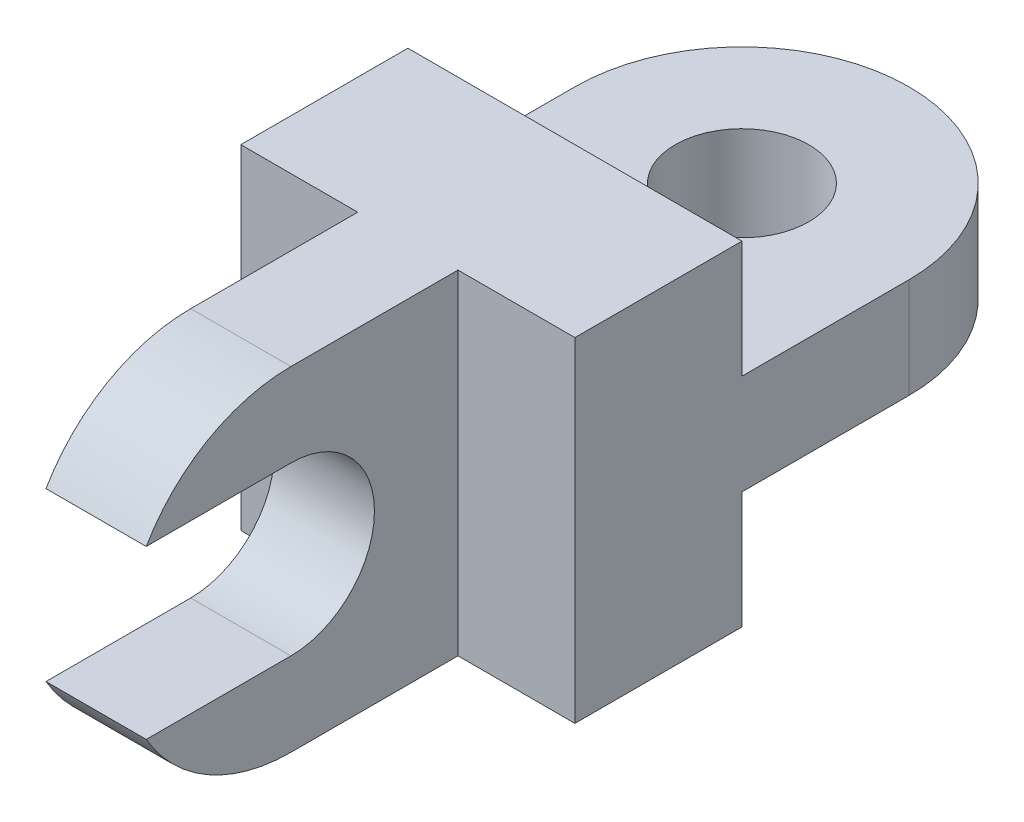
ISO-10303-21;
HEADER;
FILE_DESCRIPTION(('STEP AP214'),'2;1');
FILE_NAME('part.step','',(''),(''),'','','');
FILE_SCHEMA(('AUTOMOTIVE_DESIGN { 1 0 10303 214 1 1 1 1 }'));
ENDSEC;
DATA;
#1=APPLICATION_CONTEXT('core data for automotive mechanical design processes');
#2=APPLICATION_PROTOCOL_DEFINITION('international standard','automotive_design',2000,#1);
#3=PRODUCT_CONTEXT('',#1,'mechanical');
#4=PRODUCT('Part','Part','',(#3));
#5=PRODUCT_RELATED_PRODUCT_CATEGORY('part','',(#4));
#6=PRODUCT_DEFINITION_FORMATION('','',#4);
#7=PRODUCT_DEFINITION_CONTEXT('part definition',#1,'design');
#8=PRODUCT_DEFINITION('design','',#6,#7);
#9=PRODUCT_DEFINITION_SHAPE('','',#8);
#10=(LENGTH_UNIT() NAMED_UNIT(*) SI_UNIT(.MILLI.,.METRE.));
#11=(NAMED_UNIT(*) PLANE_ANGLE_UNIT() SI_UNIT($,.RADIAN.));
#12=(NAMED_UNIT(*) SI_UNIT($,.STERADIAN.) SOLID_ANGLE_UNIT());
#13=UNCERTAINTY_MEASURE_WITH_UNIT(LENGTH_MEASURE(1.E-05),#10,'distance_accuracy_value','');
#14=(GEOMETRIC_REPRESENTATION_CONTEXT(3) GLOBAL_UNCERTAINTY_ASSIGNED_CONTEXT((#13)) GLOBAL_UNIT_ASSIGNED_CONTEXT((#10,
#11,#12)) REPRESENTATION_CONTEXT('',''));
#15=CARTESIAN_POINT('',(0.,0.,0.));
#16=DIRECTION('',(0.,0.,1.));
#17=DIRECTION('',(1.,0.,0.));
#18=AXIS2_PLACEMENT_3D('',#15,#16,#17);
#19=CARTESIAN_POINT('',(-50.,65.,100.));
#20=DIRECTION('',(0.,0.,-1.));
#21=DIRECTION('',(-1.,0.,0.));
#22=AXIS2_PLACEMENT_3D('',#19,#20,#21);
#23=PLANE('',#22);
#24=DIRECTION('',(0.,1.,0.));
#25=VECTOR('',#24,1.);
#26=CARTESIAN_POINT('',(15.,-35.,100.));
#27=LINE('',#26,#25);
#28=CARTESIAN_POINT('',(15.,-35.,100.));
#29=VERTEX_POINT('',#28);
#30=CARTESIAN_POINT('',(15.,65.,100.));
#31=VERTEX_POINT('',#30);
#32=EDGE_CURVE('E170',#29,#31,#27,.T.);
#33=ORIENTED_EDGE('',*,*,#32,.F.);
#34=DIRECTION('',(-1.,0.,0.));
#35=VECTOR('',#34,1.);
#36=CARTESIAN_POINT('',(50.,-35.,100.));
#37=LINE('',#36,#35);
#38=CARTESIAN_POINT('',(50.,-35.,100.));
#39=VERTEX_POINT('',#38);
#40=EDGE_CURVE('E305',#39,#29,#37,.T.);
#41=ORIENTED_EDGE('',*,*,#40,.F.);
#42=DIRECTION('',(0.,-1.,0.));
#43=VECTOR('',#42,1.);
#44=CARTESIAN_POINT('',(50.,65.,100.));
#45=LINE('',#44,#43);
#46=CARTESIAN_POINT('',(50.,65.,100.));
#47=VERTEX_POINT('',#46);
#48=EDGE_CURVE('E181',#47,#39,#45,.T.);
#49=ORIENTED_EDGE('',*,*,#48,.F.);
#50=DIRECTION('',(1.,0.,0.));
#51=VECTOR('',#50,1.);
#52=CARTESIAN_POINT('',(-50.,65.,100.));
#53=LINE('',#52,#51);
#54=EDGE_CURVE('E164',#31,#47,#53,.T.);
#55=ORIENTED_EDGE('',*,*,#54,.F.);
#56=EDGE_LOOP('',(#33,#41,#49,#55));
#57=FACE_BOUND('',#56,.T.);
#58=ADVANCED_FACE('F45',(#57),#23,.F.);
#59=CARTESIAN_POINT('',(0.,0.,0.));
#60=DIRECTION('',(0.,1.,0.));
#61=DIRECTION('',(0.,0.,1.));
#62=AXIS2_PLACEMENT_3D('',#59,#60,#61);
#63=PLANE('',#62);
#64=CARTESIAN_POINT('',(0.,0.,0.));
#65=DIRECTION('',(0.,1.,0.));
#66=DIRECTION('',(0.,0.,1.));
#67=AXIS2_PLACEMENT_3D('',#64,#65,#66);
#68=CIRCLE('',#67,20.);
#69=CARTESIAN_POINT('',(0.,0.,20.));
#70=VERTEX_POINT('',#69);
#71=EDGE_CURVE('E210',#70,#70,#68,.T.);
#72=ORIENTED_EDGE('',*,*,#71,.T.);
#73=EDGE_LOOP('',(#72));
#74=FACE_BOUND('',#73,.T.);
#75=DIRECTION('',(1.,0.,0.));
#76=VECTOR('',#75,1.);
#77=CARTESIAN_POINT('',(50.,0.,50.));
#78=LINE('',#77,#76);
#79=CARTESIAN_POINT('',(-50.,0.,50.));
#80=VERTEX_POINT('',#79);
#81=CARTESIAN_POINT('',(50.,0.,50.));
#82=VERTEX_POINT('',#81);
#83=EDGE_CURVE('E284',#80,#82,#78,.T.);
#84=ORIENTED_EDGE('',*,*,#83,.F.);
#85=DIRECTION('',(0.,0.,1.));
#86=VECTOR('',#85,1.);
#87=CARTESIAN_POINT('',(-50.,0.,0.));
#88=LINE('',#87,#86);
#89=CARTESIAN_POINT('',(-50.,0.,0.));
#90=VERTEX_POINT('',#89);
#91=EDGE_CURVE('E239',#90,#80,#88,.T.);
#92=ORIENTED_EDGE('',*,*,#91,.F.);
#93=CARTESIAN_POINT('',(0.,0.,0.));
#94=DIRECTION('',(0.,1.,0.));
#95=DIRECTION('',(0.,0.,1.));
#96=AXIS2_PLACEMENT_3D('',#93,#94,#95);
#97=CIRCLE('',#96,50.);
#98=CARTESIAN_POINT('',(50.,0.,0.));
#99=VERTEX_POINT('',#98);
#100=EDGE_CURVE('E215',#99,#90,#97,.T.);
#101=ORIENTED_EDGE('',*,*,#100,.F.);
#102=DIRECTION('',(0.,0.,-1.));
#103=VECTOR('',#102,1.);
#104=CARTESIAN_POINT('',(50.,0.,50.));
#105=LINE('',#104,#103);
#106=EDGE_CURVE('E224',#82,#99,#105,.T.);
#107=ORIENTED_EDGE('',*,*,#106,.F.);
#108=EDGE_LOOP('',(#84,#92,#101,#107));
#109=FACE_BOUND('',#108,.T.);
#110=ADVANCED_FACE('F397',(#74,#109),#63,.F.);
#111=CARTESIAN_POINT('',(0.,30.,0.));
#112=DIRECTION('',(0.,1.,0.));
#113=DIRECTION('',(0.,0.,1.));
#114=AXIS2_PLACEMENT_3D('',#111,#112,#113);
#115=PLANE('',#114);
#116=CARTESIAN_POINT('',(0.,30.,0.));
#117=DIRECTION('',(0.,1.,0.));
#118=DIRECTION('',(0.,0.,1.));
#119=AXIS2_PLACEMENT_3D('',#116,#117,#118);
#120=CIRCLE('',#119,50.);
#121=CARTESIAN_POINT('',(50.,30.,0.));
#122=VERTEX_POINT('',#121);
#123=CARTESIAN_POINT('',(-50.,30.,0.));
#124=VERTEX_POINT('',#123);
#125=EDGE_CURVE('E219',#122,#124,#120,.T.);
#126=ORIENTED_EDGE('',*,*,#125,.T.);
#127=DIRECTION('',(0.,0.,1.));
#128=VECTOR('',#127,1.);
#129=CARTESIAN_POINT('',(-50.,30.,0.));
#130=LINE('',#129,#128);
#131=CARTESIAN_POINT('',(-50.,30.,50.));
#132=VERTEX_POINT('',#131);
#133=EDGE_CURVE('E223',#124,#132,#130,.T.);
#134=ORIENTED_EDGE('',*,*,#133,.T.);
#135=DIRECTION('',(1.,0.,0.));
#136=VECTOR('',#135,1.);
#137=CARTESIAN_POINT('',(-50.,30.,50.));
#138=LINE('',#137,#136);
#139=CARTESIAN_POINT('',(50.,30.,50.));
#140=VERTEX_POINT('',#139);
#141=EDGE_CURVE('E228',#132,#140,#138,.T.);
#142=ORIENTED_EDGE('',*,*,#141,.T.);
#143=DIRECTION('',(0.,0.,-1.));
#144=VECTOR('',#143,1.);
#145=CARTESIAN_POINT('',(50.,30.,50.));
#146=LINE('',#145,#144);
#147=EDGE_CURVE('E232',#140,#122,#146,.T.);
#148=ORIENTED_EDGE('',*,*,#147,.T.);
#149=EDGE_LOOP('',(#126,#134,#142,#148));
#150=FACE_BOUND('',#149,.T.);
#151=CARTESIAN_POINT('',(0.,30.,0.));
#152=DIRECTION('',(0.,1.,0.));
#153=DIRECTION('',(0.,0.,1.));
#154=AXIS2_PLACEMENT_3D('',#151,#152,#153);
#155=CIRCLE('',#154,20.);
#156=CARTESIAN_POINT('',(0.,30.,20.));
#157=VERTEX_POINT('',#156);
#158=EDGE_CURVE('E211',#157,#157,#155,.T.);
#159=ORIENTED_EDGE('',*,*,#158,.F.);
#160=EDGE_LOOP('',(#159));
#161=FACE_BOUND('',#160,.T.);
#162=ADVANCED_FACE('F332',(#150,#161),#115,.T.);
#163=CARTESIAN_POINT('',(0.,30.,0.));
#164=DIRECTION('',(0.,-1.,0.));
#165=DIRECTION('',(0.,0.,-1.));
#166=AXIS2_PLACEMENT_3D('',#163,#164,#165);
#167=CYLINDRICAL_SURFACE('',#166,50.);
#168=ORIENTED_EDGE('',*,*,#100,.T.);
#169=DIRECTION('',(0.,-1.,0.));
#170=VECTOR('',#169,1.);
#171=CARTESIAN_POINT('',(-50.,30.,0.));
#172=LINE('',#171,#170);
#173=EDGE_CURVE('E248',#124,#90,#172,.T.);
#174=ORIENTED_EDGE('',*,*,#173,.F.);
#175=ORIENTED_EDGE('',*,*,#125,.F.);
#176=DIRECTION('',(0.,-1.,0.));
#177=VECTOR('',#176,1.);
#178=CARTESIAN_POINT('',(50.,30.,0.));
#179=LINE('',#178,#177);
#180=EDGE_CURVE('E235',#122,#99,#179,.T.);
#181=ORIENTED_EDGE('',*,*,#180,.T.);
#182=EDGE_LOOP('',(#168,#174,#175,#181));
#183=FACE_BOUND('',#182,.T.);
#184=ADVANCED_FACE('F339',(#183),#167,.T.);
#185=CARTESIAN_POINT('',(-50.,30.,0.));
#186=DIRECTION('',(1.,0.,0.));
#187=DIRECTION('',(0.,0.,-1.));
#188=AXIS2_PLACEMENT_3D('',#185,#186,#187);
#189=PLANE('',#188);
#190=ORIENTED_EDGE('',*,*,#91,.T.);
#191=DIRECTION('',(0.,1.,0.));
#192=VECTOR('',#191,1.);
#193=CARTESIAN_POINT('',(-50.,-35.,50.));
#194=LINE('',#193,#192);
#195=CARTESIAN_POINT('',(-50.,-35.,50.));
#196=VERTEX_POINT('',#195);
#197=EDGE_CURVE('E318',#196,#80,#194,.T.);
#198=ORIENTED_EDGE('',*,*,#197,.F.);
#199=DIRECTION('',(0.,0.,-1.));
#200=VECTOR('',#199,1.);
#201=CARTESIAN_POINT('',(-50.,-35.,100.));
#202=LINE('',#201,#200);
#203=CARTESIAN_POINT('',(-50.,-35.,100.));
#204=VERTEX_POINT('',#203);
#205=EDGE_CURVE('E308',#204,#196,#202,.T.);
#206=ORIENTED_EDGE('',*,*,#205,.F.);
#207=DIRECTION('',(0.,-1.,0.));
#208=VECTOR('',#207,1.);
#209=CARTESIAN_POINT('',(-50.,65.,100.));
#210=LINE('',#209,#208);
#211=CARTESIAN_POINT('',(-50.,65.,100.));
#212=VERTEX_POINT('',#211);
#213=EDGE_CURVE('E202',#212,#204,#210,.T.);
#214=ORIENTED_EDGE('',*,*,#213,.F.);
#215=DIRECTION('',(0.,0.,1.));
#216=VECTOR('',#215,1.);
#217=CARTESIAN_POINT('',(-50.,65.,50.));
#218=LINE('',#217,#216);
#219=CARTESIAN_POINT('',(-50.,65.,50.));
#220=VERTEX_POINT('',#219);
#221=EDGE_CURVE('E185',#220,#212,#218,.T.);
#222=ORIENTED_EDGE('',*,*,#221,.F.);
#223=DIRECTION('',(0.,-1.,0.));
#224=VECTOR('',#223,1.);
#225=CARTESIAN_POINT('',(-50.,65.,50.));
#226=LINE('',#225,#224);
#227=EDGE_CURVE('E206',#220,#132,#226,.T.);
#228=ORIENTED_EDGE('',*,*,#227,.T.);
#229=ORIENTED_EDGE('',*,*,#133,.F.);
#230=ORIENTED_EDGE('',*,*,#173,.T.);
#231=EDGE_LOOP('',(#190,#198,#206,#214,#222,#228,#229,#230));
#232=FACE_BOUND('',#231,.T.);
#233=ADVANCED_FACE('F330',(#232),#189,.F.);
#234=CARTESIAN_POINT('',(50.,30.,50.));
#235=DIRECTION('',(-1.,0.,0.));
#236=DIRECTION('',(0.,0.,1.));
#237=AXIS2_PLACEMENT_3D('',#234,#235,#236);
#238=PLANE('',#237);
#239=ORIENTED_EDGE('',*,*,#48,.T.);
#240=DIRECTION('',(0.,0.,1.));
#241=VECTOR('',#240,1.);
#242=CARTESIAN_POINT('',(50.,-35.,100.));
#243=LINE('',#242,#241);
#244=CARTESIAN_POINT('',(50.,-35.,50.));
#245=VERTEX_POINT('',#244);
#246=EDGE_CURVE('E289',#245,#39,#243,.T.);
#247=ORIENTED_EDGE('',*,*,#246,.F.);
#248=DIRECTION('',(0.,1.,0.));
#249=VECTOR('',#248,1.);
#250=CARTESIAN_POINT('',(50.,-35.,50.));
#251=LINE('',#250,#249);
#252=EDGE_CURVE('E313',#245,#82,#251,.T.);
#253=ORIENTED_EDGE('',*,*,#252,.T.);
#254=ORIENTED_EDGE('',*,*,#106,.T.);
#255=ORIENTED_EDGE('',*,*,#180,.F.);
#256=ORIENTED_EDGE('',*,*,#147,.F.);
#257=DIRECTION('',(0.,-1.,0.));
#258=VECTOR('',#257,1.);
#259=CARTESIAN_POINT('',(50.,65.,50.));
#260=LINE('',#259,#258);
#261=CARTESIAN_POINT('',(50.,65.,50.));
#262=VERTEX_POINT('',#261);
#263=EDGE_CURVE('E197',#262,#140,#260,.T.);
#264=ORIENTED_EDGE('',*,*,#263,.F.);
#265=DIRECTION('',(0.,0.,-1.));
#266=VECTOR('',#265,1.);
#267=CARTESIAN_POINT('',(50.,65.,100.));
#268=LINE('',#267,#266);
#269=EDGE_CURVE('E190',#47,#262,#268,.T.);
#270=ORIENTED_EDGE('',*,*,#269,.F.);
#271=EDGE_LOOP('',(#239,#247,#253,#254,#255,#256,#264,#270));
#272=FACE_BOUND('',#271,.T.);
#273=ADVANCED_FACE('F415',(#272),#238,.F.);
#274=CARTESIAN_POINT('',(0.,30.,0.));
#275=DIRECTION('',(0.,-1.,0.));
#276=DIRECTION('',(0.,0.,-1.));
#277=AXIS2_PLACEMENT_3D('',#274,#275,#276);
#278=CYLINDRICAL_SURFACE('',#277,20.);
#279=ORIENTED_EDGE('',*,*,#158,.T.);
#280=EDGE_LOOP('',(#279));
#281=FACE_BOUND('',#280,.T.);
#282=ORIENTED_EDGE('',*,*,#71,.F.);
#283=EDGE_LOOP('',(#282));
#284=FACE_BOUND('',#283,.T.);
#285=ADVANCED_FACE('F410',(#281,#284),#278,.F.);
#286=CARTESIAN_POINT('',(-50.,65.,50.));
#287=DIRECTION('',(0.,0.,1.));
#288=DIRECTION('',(1.,0.,0.));
#289=AXIS2_PLACEMENT_3D('',#286,#287,#288);
#290=PLANE('',#289);
#291=ORIENTED_EDGE('',*,*,#141,.F.);
#292=ORIENTED_EDGE('',*,*,#227,.F.);
#293=DIRECTION('',(-1.,0.,0.));
#294=VECTOR('',#293,1.);
#295=CARTESIAN_POINT('',(-50.,65.,50.));
#296=LINE('',#295,#294);
#297=EDGE_CURVE('E191',#262,#220,#296,.T.);
#298=ORIENTED_EDGE('',*,*,#297,.F.);
#299=ORIENTED_EDGE('',*,*,#263,.T.);
#300=EDGE_LOOP('',(#291,#292,#298,#299));
#301=FACE_BOUND('',#300,.T.);
#302=ADVANCED_FACE('F328',(#301),#290,.F.);
#303=CARTESIAN_POINT('',(-15.,-35.,100.));
#304=VERTEX_POINT('',#303);
#305=EDGE_CURVE('E304',#304,#204,#37,.T.);
#306=ORIENTED_EDGE('',*,*,#305,.F.);
#307=DIRECTION('',(0.,1.,0.));
#308=VECTOR('',#307,1.);
#309=CARTESIAN_POINT('',(-15.,-35.,100.));
#310=LINE('',#309,#308);
#311=CARTESIAN_POINT('',(-15.,65.,100.));
#312=VERTEX_POINT('',#311);
#313=EDGE_CURVE('E355',#304,#312,#310,.T.);
#314=ORIENTED_EDGE('',*,*,#313,.T.);
#315=EDGE_CURVE('E184',#212,#312,#53,.T.);
#316=ORIENTED_EDGE('',*,*,#315,.F.);
#317=ORIENTED_EDGE('',*,*,#213,.T.);
#318=EDGE_LOOP('',(#306,#314,#316,#317));
#319=FACE_BOUND('',#318,.T.);
#320=ADVANCED_FACE('F354',(#319),#23,.F.);
#321=CARTESIAN_POINT('',(0.,65.,0.));
#322=DIRECTION('',(0.,1.,0.));
#323=DIRECTION('',(0.,0.,1.));
#324=AXIS2_PLACEMENT_3D('',#321,#322,#323);
#325=PLANE('',#324);
#326=DIRECTION('',(0.,0.,1.));
#327=VECTOR('',#326,1.);
#328=CARTESIAN_POINT('',(-15.,65.,100.));
#329=LINE('',#328,#327);
#330=CARTESIAN_POINT('',(-15.,65.,149.998729810778));
#331=VERTEX_POINT('',#330);
#332=EDGE_CURVE('E356',#312,#331,#329,.T.);
#333=ORIENTED_EDGE('',*,*,#332,.T.);
#334=DIRECTION('',(-1.,0.,0.));
#335=VECTOR('',#334,1.);
#336=CARTESIAN_POINT('',(15.,65.,149.998729810778));
#337=LINE('',#336,#335);
#338=CARTESIAN_POINT('',(15.,65.,149.998729810778));
#339=VERTEX_POINT('',#338);
#340=EDGE_CURVE('E11',#331,#339,#337,.F.);
#341=ORIENTED_EDGE('',*,*,#340,.T.);
#342=DIRECTION('',(0.,0.,1.));
#343=VECTOR('',#342,1.);
#344=CARTESIAN_POINT('',(15.,65.,100.));
#345=LINE('',#344,#343);
#346=EDGE_CURVE('E160',#31,#339,#345,.T.);
#347=ORIENTED_EDGE('',*,*,#346,.F.);
#348=ORIENTED_EDGE('',*,*,#54,.T.);
#349=ORIENTED_EDGE('',*,*,#269,.T.);
#350=ORIENTED_EDGE('',*,*,#297,.T.);
#351=ORIENTED_EDGE('',*,*,#221,.T.);
#352=ORIENTED_EDGE('',*,*,#315,.T.);
#353=EDGE_LOOP('',(#333,#341,#347,#348,#349,#350,#351,#352));
#354=FACE_BOUND('',#353,.T.);
#355=ADVANCED_FACE('F162',(#354),#325,.T.);
#356=CARTESIAN_POINT('',(50.,-35.,50.));
#357=DIRECTION('',(0.,0.,1.));
#358=DIRECTION('',(1.,0.,0.));
#359=AXIS2_PLACEMENT_3D('',#356,#357,#358);
#360=PLANE('',#359);
#361=ORIENTED_EDGE('',*,*,#83,.T.);
#362=ORIENTED_EDGE('',*,*,#252,.F.);
#363=DIRECTION('',(1.,0.,0.));
#364=VECTOR('',#363,1.);
#365=CARTESIAN_POINT('',(50.,-35.,50.));
#366=LINE('',#365,#364);
#367=EDGE_CURVE('E311',#196,#245,#366,.T.);
#368=ORIENTED_EDGE('',*,*,#367,.F.);
#369=ORIENTED_EDGE('',*,*,#197,.T.);
#370=EDGE_LOOP('',(#361,#362,#368,#369));
#371=FACE_BOUND('',#370,.T.);
#372=ADVANCED_FACE('F346',(#371),#360,.F.);
#373=CARTESIAN_POINT('',(0.,-35.,0.));
#374=DIRECTION('',(0.,1.,0.));
#375=DIRECTION('',(0.,0.,1.));
#376=AXIS2_PLACEMENT_3D('',#373,#374,#375);
#377=PLANE('',#376);
#378=DIRECTION('',(0.,0.,-1.));
#379=VECTOR('',#378,1.);
#380=CARTESIAN_POINT('',(15.,-35.,193.3));
#381=LINE('',#380,#379);
#382=CARTESIAN_POINT('',(15.,-35.,149.998729810778));
#383=VERTEX_POINT('',#382);
#384=EDGE_CURVE('E175',#383,#29,#381,.T.);
#385=ORIENTED_EDGE('',*,*,#384,.F.);
#386=DIRECTION('',(-1.,0.,0.));
#387=VECTOR('',#386,1.);
#388=CARTESIAN_POINT('',(0.,-35.,149.998729810778));
#389=LINE('',#388,#387);
#390=CARTESIAN_POINT('',(-15.,-35.,149.998729810778));
#391=VERTEX_POINT('',#390);
#392=EDGE_CURVE('E69',#383,#391,#389,.T.);
#393=ORIENTED_EDGE('',*,*,#392,.T.);
#394=DIRECTION('',(0.,0.,-1.));
#395=VECTOR('',#394,1.);
#396=CARTESIAN_POINT('',(-15.,-35.,193.3));
#397=LINE('',#396,#395);
#398=EDGE_CURVE('E270',#391,#304,#397,.T.);
#399=ORIENTED_EDGE('',*,*,#398,.T.);
#400=ORIENTED_EDGE('',*,*,#305,.T.);
#401=ORIENTED_EDGE('',*,*,#205,.T.);
#402=ORIENTED_EDGE('',*,*,#367,.T.);
#403=ORIENTED_EDGE('',*,*,#246,.T.);
#404=ORIENTED_EDGE('',*,*,#40,.T.);
#405=EDGE_LOOP('',(#385,#393,#399,#400,#401,#402,#403,#404));
#406=FACE_BOUND('',#405,.T.);
#407=ADVANCED_FACE('F349',(#406),#377,.F.);
#408=CARTESIAN_POINT('',(-15.,-10.,150.));
#409=DIRECTION('',(0.,1.,0.));
#410=DIRECTION('',(0.,0.,1.));
#411=AXIS2_PLACEMENT_3D('',#408,#409,#410);
#412=PLANE('',#411);
#413=DIRECTION('',(1.,0.,0.));
#414=VECTOR('',#413,1.);
#415=CARTESIAN_POINT('',(-15.,-10.,193.3));
#416=LINE('',#415,#414);
#417=CARTESIAN_POINT('',(-15.,-10.,193.3));
#418=VERTEX_POINT('',#417);
#419=CARTESIAN_POINT('',(15.,-10.,193.3));
#420=VERTEX_POINT('',#419);
#421=EDGE_CURVE('E277',#418,#420,#416,.T.);
#422=ORIENTED_EDGE('',*,*,#421,.T.);
#423=DIRECTION('',(0.,0.,1.));
#424=VECTOR('',#423,1.);
#425=CARTESIAN_POINT('',(15.,-10.,150.));
#426=LINE('',#425,#424);
#427=CARTESIAN_POINT('',(15.,-10.,150.));
#428=VERTEX_POINT('',#427);
#429=EDGE_CURVE('E372',#428,#420,#426,.T.);
#430=ORIENTED_EDGE('',*,*,#429,.F.);
#431=DIRECTION('',(1.,0.,0.));
#432=VECTOR('',#431,1.);
#433=CARTESIAN_POINT('',(-15.,-10.,150.));
#434=LINE('',#433,#432);
#435=CARTESIAN_POINT('',(-15.,-10.,150.));
#436=VERTEX_POINT('',#435);
#437=EDGE_CURVE('E278',#436,#428,#434,.T.);
#438=ORIENTED_EDGE('',*,*,#437,.F.);
#439=DIRECTION('',(0.,0.,1.));
#440=VECTOR('',#439,1.);
#441=CARTESIAN_POINT('',(-15.,-10.,150.));
#442=LINE('',#441,#440);
#443=EDGE_CURVE('E267',#436,#418,#442,.T.);
#444=ORIENTED_EDGE('',*,*,#443,.T.);
#445=EDGE_LOOP('',(#422,#430,#438,#444));
#446=FACE_BOUND('',#445,.T.);
#447=ADVANCED_FACE('F275',(#446),#412,.T.);
#448=CARTESIAN_POINT('',(-15.,15.,150.));
#449=DIRECTION('',(1.,0.,0.));
#450=DIRECTION('',(0.,0.,-1.));
#451=AXIS2_PLACEMENT_3D('',#448,#449,#450);
#452=CYLINDRICAL_SURFACE('',#451,25.);
#453=ORIENTED_EDGE('',*,*,#437,.T.);
#454=CARTESIAN_POINT('',(15.,15.,150.));
#455=DIRECTION('',(-1.,0.,0.));
#456=DIRECTION('',(0.,0.,-1.));
#457=AXIS2_PLACEMENT_3D('',#454,#455,#456);
#458=CIRCLE('',#457,25.);
#459=CARTESIAN_POINT('',(15.,40.,150.));
#460=VERTEX_POINT('',#459);
#461=EDGE_CURVE('E369',#460,#428,#458,.T.);
#462=ORIENTED_EDGE('',*,*,#461,.F.);
#463=DIRECTION('',(1.,0.,0.));
#464=VECTOR('',#463,1.);
#465=CARTESIAN_POINT('',(-15.,40.,150.));
#466=LINE('',#465,#464);
#467=CARTESIAN_POINT('',(-15.,40.,150.));
#468=VERTEX_POINT('',#467);
#469=EDGE_CURVE('E291',#468,#460,#466,.T.);
#470=ORIENTED_EDGE('',*,*,#469,.F.);
#471=CARTESIAN_POINT('',(-15.,15.,150.));
#472=DIRECTION('',(-1.,0.,0.));
#473=DIRECTION('',(0.,0.,-1.));
#474=AXIS2_PLACEMENT_3D('',#471,#472,#473);
#475=CIRCLE('',#474,25.);
#476=EDGE_CURVE('E280',#468,#436,#475,.T.);
#477=ORIENTED_EDGE('',*,*,#476,.T.);
#478=EDGE_LOOP('',(#453,#462,#470,#477));
#479=FACE_BOUND('',#478,.T.);
#480=ADVANCED_FACE('F385',(#479),#452,.F.);
#481=CARTESIAN_POINT('',(-15.,40.,150.));
#482=DIRECTION('',(0.,-1.,0.));
#483=DIRECTION('',(0.,0.,-1.));
#484=AXIS2_PLACEMENT_3D('',#481,#482,#483);
#485=PLANE('',#484);
#486=ORIENTED_EDGE('',*,*,#469,.T.);
#487=DIRECTION('',(0.,0.,-1.));
#488=VECTOR('',#487,1.);
#489=CARTESIAN_POINT('',(15.,40.,150.));
#490=LINE('',#489,#488);
#491=CARTESIAN_POINT('',(15.,40.,193.3));
#492=VERTEX_POINT('',#491);
#493=EDGE_CURVE('E169',#492,#460,#490,.T.);
#494=ORIENTED_EDGE('',*,*,#493,.F.);
#495=DIRECTION('',(1.,0.,0.));
#496=VECTOR('',#495,1.);
#497=CARTESIAN_POINT('',(-15.,40.,193.3));
#498=LINE('',#497,#496);
#499=CARTESIAN_POINT('',(-15.,40.,193.3));
#500=VERTEX_POINT('',#499);
#501=EDGE_CURVE('E297',#500,#492,#498,.T.);
#502=ORIENTED_EDGE('',*,*,#501,.F.);
#503=DIRECTION('',(0.,0.,-1.));
#504=VECTOR('',#503,1.);
#505=CARTESIAN_POINT('',(-15.,40.,150.));
#506=LINE('',#505,#504);
#507=EDGE_CURVE('E358',#500,#468,#506,.T.);
#508=ORIENTED_EDGE('',*,*,#507,.T.);
#509=EDGE_LOOP('',(#486,#494,#502,#508));
#510=FACE_BOUND('',#509,.T.);
#511=ADVANCED_FACE('F366',(#510),#485,.T.);
#512=CARTESIAN_POINT('',(-15.,15.,150.));
#513=DIRECTION('',(1.,0.,0.));
#514=DIRECTION('',(0.,0.,-1.));
#515=AXIS2_PLACEMENT_3D('',#512,#513,#514);
#516=PLANE('',#515);
#517=ORIENTED_EDGE('',*,*,#398,.F.);
#518=CARTESIAN_POINT('',(-15.,15.,149.998729810778));
#519=DIRECTION('',(1.,0.,0.));
#520=DIRECTION('',(0.,0.,-1.));
#521=AXIS2_PLACEMENT_3D('',#518,#519,#520);
#522=CIRCLE('',#521,50.);
#523=EDGE_CURVE('E54',#391,#418,#522,.F.);
#524=ORIENTED_EDGE('',*,*,#523,.T.);
#525=ORIENTED_EDGE('',*,*,#443,.F.);
#526=ORIENTED_EDGE('',*,*,#476,.F.);
#527=ORIENTED_EDGE('',*,*,#507,.F.);
#528=CARTESIAN_POINT('',(-15.,15.,149.998729810778));
#529=DIRECTION('',(1.,0.,0.));
#530=DIRECTION('',(0.,0.,-1.));
#531=AXIS2_PLACEMENT_3D('',#528,#529,#530);
#532=CIRCLE('',#531,50.);
#533=EDGE_CURVE('E61',#500,#331,#532,.F.);
#534=ORIENTED_EDGE('',*,*,#533,.T.);
#535=ORIENTED_EDGE('',*,*,#332,.F.);
#536=ORIENTED_EDGE('',*,*,#313,.F.);
#537=EDGE_LOOP('',(#517,#524,#525,#526,#527,#534,#535,#536));
#538=FACE_BOUND('',#537,.T.);
#539=ADVANCED_FACE('F265',(#538),#516,.F.);
#540=CARTESIAN_POINT('',(15.,15.,150.));
#541=DIRECTION('',(1.,0.,0.));
#542=DIRECTION('',(0.,0.,-1.));
#543=AXIS2_PLACEMENT_3D('',#540,#541,#542);
#544=PLANE('',#543);
#545=ORIENTED_EDGE('',*,*,#429,.T.);
#546=CARTESIAN_POINT('',(15.,15.,149.998729810778));
#547=DIRECTION('',(1.,0.,0.));
#548=DIRECTION('',(0.,0.,-1.));
#549=AXIS2_PLACEMENT_3D('',#546,#547,#548);
#550=CIRCLE('',#549,50.);
#551=EDGE_CURVE('E255',#420,#383,#550,.T.);
#552=ORIENTED_EDGE('',*,*,#551,.T.);
#553=ORIENTED_EDGE('',*,*,#384,.T.);
#554=ORIENTED_EDGE('',*,*,#32,.T.);
#555=ORIENTED_EDGE('',*,*,#346,.T.);
#556=CARTESIAN_POINT('',(15.,15.,149.998729810778));
#557=DIRECTION('',(1.,0.,0.));
#558=DIRECTION('',(0.,0.,-1.));
#559=AXIS2_PLACEMENT_3D('',#556,#557,#558);
#560=CIRCLE('',#559,50.);
#561=EDGE_CURVE('E252',#339,#492,#560,.T.);
#562=ORIENTED_EDGE('',*,*,#561,.T.);
#563=ORIENTED_EDGE('',*,*,#493,.T.);
#564=ORIENTED_EDGE('',*,*,#461,.T.);
#565=EDGE_LOOP('',(#545,#552,#553,#554,#555,#562,#563,#564));
#566=FACE_BOUND('',#565,.T.);
#567=ADVANCED_FACE('F174',(#566),#544,.T.);
#568=CARTESIAN_POINT('',(-15.,15.,149.998729810778));
#569=DIRECTION('',(-1.,0.,0.));
#570=DIRECTION('',(0.,0.,1.));
#571=AXIS2_PLACEMENT_3D('',#568,#569,#570);
#572=CYLINDRICAL_SURFACE('',#571,50.);
#573=ORIENTED_EDGE('',*,*,#523,.F.);
#574=ORIENTED_EDGE('',*,*,#392,.F.);
#575=ORIENTED_EDGE('',*,*,#551,.F.);
#576=ORIENTED_EDGE('',*,*,#421,.F.);
#577=EDGE_LOOP('',(#573,#574,#575,#576));
#578=FACE_BOUND('',#577,.T.);
#579=ADVANCED_FACE('F282',(#578),#572,.T.);
#580=CARTESIAN_POINT('',(-15.,15.,149.998729810778));
#581=DIRECTION('',(1.,0.,0.));
#582=DIRECTION('',(0.,0.,-1.));
#583=AXIS2_PLACEMENT_3D('',#580,#581,#582);
#584=CYLINDRICAL_SURFACE('',#583,50.);
#585=ORIENTED_EDGE('',*,*,#533,.F.);
#586=ORIENTED_EDGE('',*,*,#501,.T.);
#587=ORIENTED_EDGE('',*,*,#561,.F.);
#588=ORIENTED_EDGE('',*,*,#340,.F.);
#589=EDGE_LOOP('',(#585,#586,#587,#588));
#590=FACE_BOUND('',#589,.T.);
#591=ADVANCED_FACE('F47',(#590),#584,.T.);
#592=CLOSED_SHELL('',(#58,#110,#162,#184,#233,#273,#285,#302,#320,#355,#372,#407,#447,#480,#511,
#539,#567,#579,#591));
#593=MANIFOLD_SOLID_BREP('B2',#592);
#594=ADVANCED_BREP_SHAPE_REPRESENTATION('',(#18,#593),#14);
#595=SHAPE_DEFINITION_REPRESENTATION(#9,#594);
ENDSEC;
END-ISO-10303-21;
